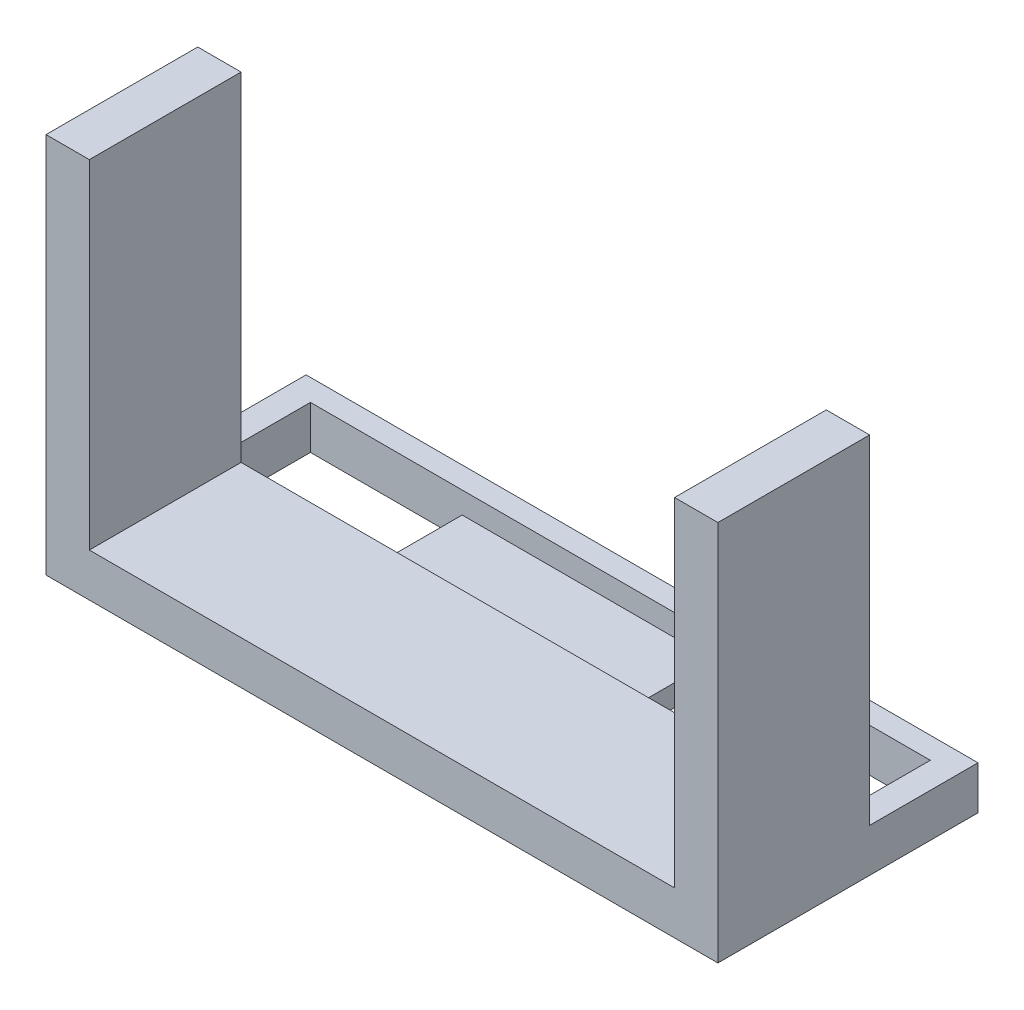
ISO-10303-21;
HEADER;
FILE_DESCRIPTION(('STEP AP214'),'2;1');
FILE_NAME('part.step','',(''),(''),'','','');
FILE_SCHEMA(('AUTOMOTIVE_DESIGN { 1 0 10303 214 1 1 1 1 }'));
ENDSEC;
DATA;
#1=APPLICATION_CONTEXT('core data for automotive mechanical design processes');
#2=APPLICATION_PROTOCOL_DEFINITION('international standard','automotive_design',2000,#1);
#3=PRODUCT_CONTEXT('',#1,'mechanical');
#4=PRODUCT('Part','Part','',(#3));
#5=PRODUCT_RELATED_PRODUCT_CATEGORY('part','',(#4));
#6=PRODUCT_DEFINITION_FORMATION('','',#4);
#7=PRODUCT_DEFINITION_CONTEXT('part definition',#1,'design');
#8=PRODUCT_DEFINITION('design','',#6,#7);
#9=PRODUCT_DEFINITION_SHAPE('','',#8);
#10=(LENGTH_UNIT() NAMED_UNIT(*) SI_UNIT(.MILLI.,.METRE.));
#11=(NAMED_UNIT(*) PLANE_ANGLE_UNIT() SI_UNIT($,.RADIAN.));
#12=(NAMED_UNIT(*) SI_UNIT($,.STERADIAN.) SOLID_ANGLE_UNIT());
#13=UNCERTAINTY_MEASURE_WITH_UNIT(LENGTH_MEASURE(1.E-05),#10,'distance_accuracy_value','');
#14=(GEOMETRIC_REPRESENTATION_CONTEXT(3) GLOBAL_UNCERTAINTY_ASSIGNED_CONTEXT((#13)) GLOBAL_UNIT_ASSIGNED_CONTEXT((#10,
#11,#12)) REPRESENTATION_CONTEXT('',''));
#15=CARTESIAN_POINT('',(0.,0.,0.));
#16=DIRECTION('',(0.,0.,1.));
#17=DIRECTION('',(1.,0.,0.));
#18=AXIS2_PLACEMENT_3D('',#15,#16,#17);
#19=CARTESIAN_POINT('',(0.,10.,0.));
#20=DIRECTION('',(0.,1.,0.));
#21=DIRECTION('',(0.,0.,1.));
#22=AXIS2_PLACEMENT_3D('',#19,#20,#21);
#23=PLANE('',#22);
#24=DIRECTION('',(1.,0.,0.));
#25=VECTOR('',#24,1.);
#26=CARTESIAN_POINT('',(0.,10.,60.));
#27=LINE('',#26,#25);
#28=CARTESIAN_POINT('',(10.,10.,60.));
#29=VERTEX_POINT('',#28);
#30=CARTESIAN_POINT('',(145.,10.,60.));
#31=VERTEX_POINT('',#30);
#32=EDGE_CURVE('E227',#29,#31,#27,.T.);
#33=ORIENTED_EDGE('',*,*,#32,.T.);
#34=DIRECTION('',(0.,0.,1.));
#35=VECTOR('',#34,1.);
#36=CARTESIAN_POINT('',(145.,10.,25.));
#37=LINE('',#36,#35);
#38=CARTESIAN_POINT('',(145.,10.,25.));
#39=VERTEX_POINT('',#38);
#40=EDGE_CURVE('E175',#39,#31,#37,.T.);
#41=ORIENTED_EDGE('',*,*,#40,.F.);
#42=DIRECTION('',(1.,0.,0.));
#43=VECTOR('',#42,1.);
#44=CARTESIAN_POINT('',(6.,10.,25.));
#45=LINE('',#44,#43);
#46=CARTESIAN_POINT('',(10.,10.,25.));
#47=VERTEX_POINT('',#46);
#48=EDGE_CURVE('E203',#47,#39,#45,.T.);
#49=ORIENTED_EDGE('',*,*,#48,.F.);
#50=DIRECTION('',(0.,0.,-1.));
#51=VECTOR('',#50,1.);
#52=CARTESIAN_POINT('',(10.,10.,25.));
#53=LINE('',#52,#51);
#54=EDGE_CURVE('E336',#29,#47,#53,.T.);
#55=ORIENTED_EDGE('',*,*,#54,.F.);
#56=EDGE_LOOP('',(#33,#41,#49,#55));
#57=FACE_BOUND('',#56,.T.);
#58=ADVANCED_FACE('F39',(#57),#23,.T.);
#59=DIRECTION('',(0.,0.,-1.));
#60=VECTOR('',#59,1.);
#61=CARTESIAN_POINT('',(149.,10.,5.));
#62=LINE('',#61,#60);
#63=CARTESIAN_POINT('',(149.,10.,25.));
#64=VERTEX_POINT('',#63);
#65=CARTESIAN_POINT('',(149.,10.,5.));
#66=VERTEX_POINT('',#65);
#67=EDGE_CURVE('E208',#64,#66,#62,.T.);
#68=ORIENTED_EDGE('',*,*,#67,.F.);
#69=DIRECTION('',(-1.,0.,0.));
#70=VECTOR('',#69,1.);
#71=CARTESIAN_POINT('',(145.,10.,25.));
#72=LINE('',#71,#70);
#73=CARTESIAN_POINT('',(155.,10.,25.));
#74=VERTEX_POINT('',#73);
#75=EDGE_CURVE('E312',#74,#64,#72,.T.);
#76=ORIENTED_EDGE('',*,*,#75,.F.);
#77=DIRECTION('',(0.,0.,-1.));
#78=VECTOR('',#77,1.);
#79=CARTESIAN_POINT('',(155.,10.,0.));
#80=LINE('',#79,#78);
#81=CARTESIAN_POINT('',(155.,10.,0.));
#82=VERTEX_POINT('',#81);
#83=EDGE_CURVE('E232',#74,#82,#80,.T.);
#84=ORIENTED_EDGE('',*,*,#83,.T.);
#85=DIRECTION('',(-1.,0.,0.));
#86=VECTOR('',#85,1.);
#87=CARTESIAN_POINT('',(0.,10.,0.));
#88=LINE('',#87,#86);
#89=CARTESIAN_POINT('',(0.,10.,0.));
#90=VERTEX_POINT('',#89);
#91=EDGE_CURVE('E235',#82,#90,#88,.T.);
#92=ORIENTED_EDGE('',*,*,#91,.T.);
#93=DIRECTION('',(0.,0.,1.));
#94=VECTOR('',#93,1.);
#95=CARTESIAN_POINT('',(0.,10.,0.));
#96=LINE('',#95,#94);
#97=CARTESIAN_POINT('',(0.,10.,25.));
#98=VERTEX_POINT('',#97);
#99=EDGE_CURVE('E224',#90,#98,#96,.T.);
#100=ORIENTED_EDGE('',*,*,#99,.T.);
#101=DIRECTION('',(-1.,0.,0.));
#102=VECTOR('',#101,1.);
#103=CARTESIAN_POINT('',(10.,10.,25.));
#104=LINE('',#103,#102);
#105=CARTESIAN_POINT('',(6.,10.,25.));
#106=VERTEX_POINT('',#105);
#107=EDGE_CURVE('E265',#106,#98,#104,.T.);
#108=ORIENTED_EDGE('',*,*,#107,.F.);
#109=DIRECTION('',(0.,0.,1.));
#110=VECTOR('',#109,1.);
#111=CARTESIAN_POINT('',(6.,10.,5.));
#112=LINE('',#111,#110);
#113=CARTESIAN_POINT('',(6.,10.,5.));
#114=VERTEX_POINT('',#113);
#115=EDGE_CURVE('E199',#114,#106,#112,.T.);
#116=ORIENTED_EDGE('',*,*,#115,.F.);
#117=DIRECTION('',(-1.,0.,0.));
#118=VECTOR('',#117,1.);
#119=CARTESIAN_POINT('',(6.,10.,5.));
#120=LINE('',#119,#118);
#121=EDGE_CURVE('E195',#66,#114,#120,.T.);
#122=ORIENTED_EDGE('',*,*,#121,.F.);
#123=EDGE_LOOP('',(#68,#76,#84,#92,#100,#108,#116,#122));
#124=FACE_BOUND('',#123,.T.);
#125=ADVANCED_FACE('F395',(#124),#23,.T.);
#126=CARTESIAN_POINT('',(0.,10.,0.));
#127=DIRECTION('',(1.,0.,0.));
#128=DIRECTION('',(0.,0.,-1.));
#129=AXIS2_PLACEMENT_3D('',#126,#127,#128);
#130=PLANE('',#129);
#131=DIRECTION('',(0.,0.,1.));
#132=VECTOR('',#131,1.);
#133=CARTESIAN_POINT('',(0.,0.,0.));
#134=LINE('',#133,#132);
#135=CARTESIAN_POINT('',(0.,0.,0.));
#136=VERTEX_POINT('',#135);
#137=CARTESIAN_POINT('',(0.,0.,60.));
#138=VERTEX_POINT('',#137);
#139=EDGE_CURVE('E217',#136,#138,#134,.T.);
#140=ORIENTED_EDGE('',*,*,#139,.T.);
#141=DIRECTION('',(0.,-1.,0.));
#142=VECTOR('',#141,1.);
#143=CARTESIAN_POINT('',(0.,10.,60.));
#144=LINE('',#143,#142);
#145=CARTESIAN_POINT('',(0.,88.,60.));
#146=VERTEX_POINT('',#145);
#147=EDGE_CURVE('E261',#146,#138,#144,.T.);
#148=ORIENTED_EDGE('',*,*,#147,.F.);
#149=DIRECTION('',(0.,0.,1.));
#150=VECTOR('',#149,1.);
#151=CARTESIAN_POINT('',(0.,88.,25.));
#152=LINE('',#151,#150);
#153=CARTESIAN_POINT('',(0.,88.,25.));
#154=VERTEX_POINT('',#153);
#155=EDGE_CURVE('E344',#154,#146,#152,.T.);
#156=ORIENTED_EDGE('',*,*,#155,.F.);
#157=DIRECTION('',(0.,-1.,0.));
#158=VECTOR('',#157,1.);
#159=CARTESIAN_POINT('',(0.,88.,25.));
#160=LINE('',#159,#158);
#161=EDGE_CURVE('E360',#154,#98,#160,.T.);
#162=ORIENTED_EDGE('',*,*,#161,.T.);
#163=ORIENTED_EDGE('',*,*,#99,.F.);
#164=DIRECTION('',(0.,-1.,0.));
#165=VECTOR('',#164,1.);
#166=CARTESIAN_POINT('',(0.,10.,0.));
#167=LINE('',#166,#165);
#168=EDGE_CURVE('E238',#90,#136,#167,.T.);
#169=ORIENTED_EDGE('',*,*,#168,.T.);
#170=EDGE_LOOP('',(#140,#148,#156,#162,#163,#169));
#171=FACE_BOUND('',#170,.T.);
#172=ADVANCED_FACE('F41',(#171),#130,.F.);
#173=CARTESIAN_POINT('',(0.,10.,60.));
#174=DIRECTION('',(0.,0.,-1.));
#175=DIRECTION('',(-1.,0.,0.));
#176=AXIS2_PLACEMENT_3D('',#173,#174,#175);
#177=PLANE('',#176);
#178=DIRECTION('',(1.,0.,0.));
#179=VECTOR('',#178,1.);
#180=CARTESIAN_POINT('',(0.,0.,60.));
#181=LINE('',#180,#179);
#182=CARTESIAN_POINT('',(155.,0.,60.));
#183=VERTEX_POINT('',#182);
#184=EDGE_CURVE('E242',#138,#183,#181,.T.);
#185=ORIENTED_EDGE('',*,*,#184,.T.);
#186=DIRECTION('',(0.,-1.,0.));
#187=VECTOR('',#186,1.);
#188=CARTESIAN_POINT('',(155.,10.,60.));
#189=LINE('',#188,#187);
#190=CARTESIAN_POINT('',(155.,88.,60.));
#191=VERTEX_POINT('',#190);
#192=EDGE_CURVE('E257',#191,#183,#189,.T.);
#193=ORIENTED_EDGE('',*,*,#192,.F.);
#194=DIRECTION('',(1.,0.,0.));
#195=VECTOR('',#194,1.);
#196=CARTESIAN_POINT('',(145.,88.,60.));
#197=LINE('',#196,#195);
#198=CARTESIAN_POINT('',(145.,88.,60.));
#199=VERTEX_POINT('',#198);
#200=EDGE_CURVE('E311',#199,#191,#197,.T.);
#201=ORIENTED_EDGE('',*,*,#200,.F.);
#202=DIRECTION('',(0.,-1.,0.));
#203=VECTOR('',#202,1.);
#204=CARTESIAN_POINT('',(145.,88.,60.));
#205=LINE('',#204,#203);
#206=EDGE_CURVE('E333',#199,#31,#205,.T.);
#207=ORIENTED_EDGE('',*,*,#206,.T.);
#208=ORIENTED_EDGE('',*,*,#32,.F.);
#209=DIRECTION('',(0.,-1.,0.));
#210=VECTOR('',#209,1.);
#211=CARTESIAN_POINT('',(10.,88.,60.));
#212=LINE('',#211,#210);
#213=CARTESIAN_POINT('',(10.,88.,60.));
#214=VERTEX_POINT('',#213);
#215=EDGE_CURVE('E351',#214,#29,#212,.T.);
#216=ORIENTED_EDGE('',*,*,#215,.F.);
#217=DIRECTION('',(1.,0.,0.));
#218=VECTOR('',#217,1.);
#219=CARTESIAN_POINT('',(10.,88.,60.));
#220=LINE('',#219,#218);
#221=EDGE_CURVE('E348',#146,#214,#220,.T.);
#222=ORIENTED_EDGE('',*,*,#221,.F.);
#223=ORIENTED_EDGE('',*,*,#147,.T.);
#224=EDGE_LOOP('',(#185,#193,#201,#207,#208,#216,#222,#223));
#225=FACE_BOUND('',#224,.T.);
#226=ADVANCED_FACE('F376',(#225),#177,.F.);
#227=CARTESIAN_POINT('',(155.,10.,0.));
#228=DIRECTION('',(-1.,0.,0.));
#229=DIRECTION('',(0.,0.,1.));
#230=AXIS2_PLACEMENT_3D('',#227,#228,#229);
#231=PLANE('',#230);
#232=DIRECTION('',(0.,0.,-1.));
#233=VECTOR('',#232,1.);
#234=CARTESIAN_POINT('',(155.,0.,0.));
#235=LINE('',#234,#233);
#236=CARTESIAN_POINT('',(155.,0.,0.));
#237=VERTEX_POINT('',#236);
#238=EDGE_CURVE('E245',#183,#237,#235,.T.);
#239=ORIENTED_EDGE('',*,*,#238,.T.);
#240=DIRECTION('',(0.,-1.,0.));
#241=VECTOR('',#240,1.);
#242=CARTESIAN_POINT('',(155.,10.,0.));
#243=LINE('',#242,#241);
#244=EDGE_CURVE('E253',#82,#237,#243,.T.);
#245=ORIENTED_EDGE('',*,*,#244,.F.);
#246=ORIENTED_EDGE('',*,*,#83,.F.);
#247=DIRECTION('',(0.,-1.,0.));
#248=VECTOR('',#247,1.);
#249=CARTESIAN_POINT('',(155.,88.,25.));
#250=LINE('',#249,#248);
#251=CARTESIAN_POINT('',(155.,88.,25.));
#252=VERTEX_POINT('',#251);
#253=EDGE_CURVE('E330',#252,#74,#250,.T.);
#254=ORIENTED_EDGE('',*,*,#253,.F.);
#255=DIRECTION('',(0.,0.,-1.));
#256=VECTOR('',#255,1.);
#257=CARTESIAN_POINT('',(155.,88.,25.));
#258=LINE('',#257,#256);
#259=EDGE_CURVE('E316',#191,#252,#258,.T.);
#260=ORIENTED_EDGE('',*,*,#259,.F.);
#261=ORIENTED_EDGE('',*,*,#192,.T.);
#262=EDGE_LOOP('',(#239,#245,#246,#254,#260,#261));
#263=FACE_BOUND('',#262,.T.);
#264=ADVANCED_FACE('F390',(#263),#231,.F.);
#265=CARTESIAN_POINT('',(0.,10.,0.));
#266=DIRECTION('',(0.,0.,1.));
#267=DIRECTION('',(1.,0.,0.));
#268=AXIS2_PLACEMENT_3D('',#265,#266,#267);
#269=PLANE('',#268);
#270=DIRECTION('',(-1.,0.,0.));
#271=VECTOR('',#270,1.);
#272=CARTESIAN_POINT('',(0.,0.,0.));
#273=LINE('',#272,#271);
#274=EDGE_CURVE('E228',#237,#136,#273,.T.);
#275=ORIENTED_EDGE('',*,*,#274,.T.);
#276=ORIENTED_EDGE('',*,*,#168,.F.);
#277=ORIENTED_EDGE('',*,*,#91,.F.);
#278=ORIENTED_EDGE('',*,*,#244,.T.);
#279=EDGE_LOOP('',(#275,#276,#277,#278));
#280=FACE_BOUND('',#279,.T.);
#281=ADVANCED_FACE('F415',(#280),#269,.F.);
#282=CARTESIAN_POINT('',(0.,0.,0.));
#283=DIRECTION('',(0.,1.,0.));
#284=DIRECTION('',(0.,0.,1.));
#285=AXIS2_PLACEMENT_3D('',#282,#283,#284);
#286=PLANE('',#285);
#287=DIRECTION('',(-1.,0.,0.));
#288=VECTOR('',#287,1.);
#289=CARTESIAN_POINT('',(0.,0.,5.));
#290=LINE('',#289,#288);
#291=CARTESIAN_POINT('',(41.,0.,5.));
#292=VERTEX_POINT('',#291);
#293=CARTESIAN_POINT('',(6.,0.,5.));
#294=VERTEX_POINT('',#293);
#295=EDGE_CURVE('E48',#292,#294,#290,.T.);
#296=ORIENTED_EDGE('',*,*,#295,.T.);
#297=DIRECTION('',(0.,0.,1.));
#298=VECTOR('',#297,1.);
#299=CARTESIAN_POINT('',(6.,0.,0.));
#300=LINE('',#299,#298);
#301=CARTESIAN_POINT('',(6.,0.,25.));
#302=VERTEX_POINT('',#301);
#303=EDGE_CURVE('E11',#294,#302,#300,.T.);
#304=ORIENTED_EDGE('',*,*,#303,.T.);
#305=DIRECTION('',(1.,0.,0.));
#306=VECTOR('',#305,1.);
#307=CARTESIAN_POINT('',(0.,0.,25.));
#308=LINE('',#307,#306);
#309=CARTESIAN_POINT('',(41.,0.,25.));
#310=VERTEX_POINT('',#309);
#311=EDGE_CURVE('E282',#302,#310,#308,.T.);
#312=ORIENTED_EDGE('',*,*,#311,.T.);
#313=DIRECTION('',(0.,0.,-1.));
#314=VECTOR('',#313,1.);
#315=CARTESIAN_POINT('',(41.,0.,0.));
#316=LINE('',#315,#314);
#317=EDGE_CURVE('E286',#310,#292,#316,.T.);
#318=ORIENTED_EDGE('',*,*,#317,.T.);
#319=EDGE_LOOP('',(#296,#304,#312,#318));
#320=FACE_BOUND('',#319,.T.);
#321=DIRECTION('',(-1.,0.,0.));
#322=VECTOR('',#321,1.);
#323=CARTESIAN_POINT('',(0.,0.,5.));
#324=LINE('',#323,#322);
#325=CARTESIAN_POINT('',(149.,0.,5.));
#326=VERTEX_POINT('',#325);
#327=CARTESIAN_POINT('',(99.,0.,5.));
#328=VERTEX_POINT('',#327);
#329=EDGE_CURVE('E274',#326,#328,#324,.T.);
#330=ORIENTED_EDGE('',*,*,#329,.T.);
#331=DIRECTION('',(0.,0.,1.));
#332=VECTOR('',#331,1.);
#333=CARTESIAN_POINT('',(99.,0.,0.));
#334=LINE('',#333,#332);
#335=CARTESIAN_POINT('',(99.,0.,25.));
#336=VERTEX_POINT('',#335);
#337=EDGE_CURVE('E278',#328,#336,#334,.T.);
#338=ORIENTED_EDGE('',*,*,#337,.T.);
#339=DIRECTION('',(1.,0.,0.));
#340=VECTOR('',#339,1.);
#341=CARTESIAN_POINT('',(0.,0.,25.));
#342=LINE('',#341,#340);
#343=CARTESIAN_POINT('',(149.,0.,25.));
#344=VERTEX_POINT('',#343);
#345=EDGE_CURVE('E266',#336,#344,#342,.T.);
#346=ORIENTED_EDGE('',*,*,#345,.T.);
#347=DIRECTION('',(0.,0.,-1.));
#348=VECTOR('',#347,1.);
#349=CARTESIAN_POINT('',(149.,0.,0.));
#350=LINE('',#349,#348);
#351=EDGE_CURVE('E270',#344,#326,#350,.T.);
#352=ORIENTED_EDGE('',*,*,#351,.T.);
#353=EDGE_LOOP('',(#330,#338,#346,#352));
#354=FACE_BOUND('',#353,.T.);
#355=ORIENTED_EDGE('',*,*,#139,.F.);
#356=ORIENTED_EDGE('',*,*,#274,.F.);
#357=ORIENTED_EDGE('',*,*,#238,.F.);
#358=ORIENTED_EDGE('',*,*,#184,.F.);
#359=EDGE_LOOP('',(#355,#356,#357,#358));
#360=FACE_BOUND('',#359,.T.);
#361=ADVANCED_FACE('F290',(#320,#354,#360),#286,.F.);
#362=CARTESIAN_POINT('',(6.,5.,5.));
#363=DIRECTION('',(-1.,0.,0.));
#364=DIRECTION('',(0.,0.,1.));
#365=AXIS2_PLACEMENT_3D('',#362,#363,#364);
#366=PLANE('',#365);
#367=ORIENTED_EDGE('',*,*,#115,.T.);
#368=DIRECTION('',(0.,1.,0.));
#369=VECTOR('',#368,1.);
#370=CARTESIAN_POINT('',(6.,5.,25.));
#371=LINE('',#370,#369);
#372=EDGE_CURVE('E187',#302,#106,#371,.T.);
#373=ORIENTED_EDGE('',*,*,#372,.F.);
#374=ORIENTED_EDGE('',*,*,#303,.F.);
#375=DIRECTION('',(0.,1.,0.));
#376=VECTOR('',#375,1.);
#377=CARTESIAN_POINT('',(6.,5.,5.));
#378=LINE('',#377,#376);
#379=EDGE_CURVE('E214',#294,#114,#378,.T.);
#380=ORIENTED_EDGE('',*,*,#379,.T.);
#381=EDGE_LOOP('',(#367,#373,#374,#380));
#382=FACE_BOUND('',#381,.T.);
#383=ADVANCED_FACE('F407',(#382),#366,.F.);
#384=CARTESIAN_POINT('',(6.,5.,5.));
#385=DIRECTION('',(0.,0.,-1.));
#386=DIRECTION('',(-1.,0.,0.));
#387=AXIS2_PLACEMENT_3D('',#384,#385,#386);
#388=PLANE('',#387);
#389=ORIENTED_EDGE('',*,*,#121,.T.);
#390=ORIENTED_EDGE('',*,*,#379,.F.);
#391=ORIENTED_EDGE('',*,*,#295,.F.);
#392=DIRECTION('',(0.,1.,0.));
#393=VECTOR('',#392,1.);
#394=CARTESIAN_POINT('',(41.,-73.,5.));
#395=LINE('',#394,#393);
#396=CARTESIAN_POINT('',(41.,5.,5.));
#397=VERTEX_POINT('',#396);
#398=EDGE_CURVE('E167',#292,#397,#395,.T.);
#399=ORIENTED_EDGE('',*,*,#398,.T.);
#400=DIRECTION('',(-1.,0.,0.));
#401=VECTOR('',#400,1.);
#402=CARTESIAN_POINT('',(6.,5.,5.));
#403=LINE('',#402,#401);
#404=CARTESIAN_POINT('',(99.,5.,5.));
#405=VERTEX_POINT('',#404);
#406=EDGE_CURVE('E171',#405,#397,#403,.T.);
#407=ORIENTED_EDGE('',*,*,#406,.F.);
#408=DIRECTION('',(0.,1.,0.));
#409=VECTOR('',#408,1.);
#410=CARTESIAN_POINT('',(99.,-73.,5.));
#411=LINE('',#410,#409);
#412=EDGE_CURVE('E55',#328,#405,#411,.T.);
#413=ORIENTED_EDGE('',*,*,#412,.F.);
#414=ORIENTED_EDGE('',*,*,#329,.F.);
#415=DIRECTION('',(0.,1.,0.));
#416=VECTOR('',#415,1.);
#417=CARTESIAN_POINT('',(149.,5.,5.));
#418=LINE('',#417,#416);
#419=EDGE_CURVE('E218',#326,#66,#418,.T.);
#420=ORIENTED_EDGE('',*,*,#419,.T.);
#421=EDGE_LOOP('',(#389,#390,#391,#399,#407,#413,#414,#420));
#422=FACE_BOUND('',#421,.T.);
#423=ADVANCED_FACE('F169',(#422),#388,.F.);
#424=CARTESIAN_POINT('',(149.,5.,5.));
#425=DIRECTION('',(1.,0.,0.));
#426=DIRECTION('',(0.,0.,-1.));
#427=AXIS2_PLACEMENT_3D('',#424,#425,#426);
#428=PLANE('',#427);
#429=ORIENTED_EDGE('',*,*,#67,.T.);
#430=ORIENTED_EDGE('',*,*,#419,.F.);
#431=ORIENTED_EDGE('',*,*,#351,.F.);
#432=DIRECTION('',(0.,1.,0.));
#433=VECTOR('',#432,1.);
#434=CARTESIAN_POINT('',(149.,5.,25.));
#435=LINE('',#434,#433);
#436=EDGE_CURVE('E193',#344,#64,#435,.T.);
#437=ORIENTED_EDGE('',*,*,#436,.T.);
#438=EDGE_LOOP('',(#429,#430,#431,#437));
#439=FACE_BOUND('',#438,.T.);
#440=ADVANCED_FACE('F400',(#439),#428,.F.);
#441=CARTESIAN_POINT('',(6.,5.,25.));
#442=DIRECTION('',(0.,0.,1.));
#443=DIRECTION('',(1.,0.,0.));
#444=AXIS2_PLACEMENT_3D('',#441,#442,#443);
#445=PLANE('',#444);
#446=ORIENTED_EDGE('',*,*,#372,.T.);
#447=ORIENTED_EDGE('',*,*,#107,.T.);
#448=ORIENTED_EDGE('',*,*,#161,.F.);
#449=DIRECTION('',(-1.,0.,0.));
#450=VECTOR('',#449,1.);
#451=CARTESIAN_POINT('',(10.,88.,25.));
#452=LINE('',#451,#450);
#453=CARTESIAN_POINT('',(10.,88.,25.));
#454=VERTEX_POINT('',#453);
#455=EDGE_CURVE('E341',#454,#154,#452,.T.);
#456=ORIENTED_EDGE('',*,*,#455,.F.);
#457=DIRECTION('',(0.,-1.,0.));
#458=VECTOR('',#457,1.);
#459=CARTESIAN_POINT('',(10.,88.,25.));
#460=LINE('',#459,#458);
#461=EDGE_CURVE('E204',#454,#47,#460,.T.);
#462=ORIENTED_EDGE('',*,*,#461,.T.);
#463=ORIENTED_EDGE('',*,*,#48,.T.);
#464=DIRECTION('',(0.,-1.,0.));
#465=VECTOR('',#464,1.);
#466=CARTESIAN_POINT('',(145.,88.,25.));
#467=LINE('',#466,#465);
#468=CARTESIAN_POINT('',(145.,88.,25.));
#469=VERTEX_POINT('',#468);
#470=EDGE_CURVE('E322',#469,#39,#467,.T.);
#471=ORIENTED_EDGE('',*,*,#470,.F.);
#472=DIRECTION('',(-1.,0.,0.));
#473=VECTOR('',#472,1.);
#474=CARTESIAN_POINT('',(145.,88.,25.));
#475=LINE('',#474,#473);
#476=EDGE_CURVE('E319',#252,#469,#475,.T.);
#477=ORIENTED_EDGE('',*,*,#476,.F.);
#478=ORIENTED_EDGE('',*,*,#253,.T.);
#479=ORIENTED_EDGE('',*,*,#75,.T.);
#480=ORIENTED_EDGE('',*,*,#436,.F.);
#481=ORIENTED_EDGE('',*,*,#345,.F.);
#482=DIRECTION('',(0.,1.,0.));
#483=VECTOR('',#482,1.);
#484=CARTESIAN_POINT('',(99.,-73.,25.));
#485=LINE('',#484,#483);
#486=CARTESIAN_POINT('',(99.,5.,25.));
#487=VERTEX_POINT('',#486);
#488=EDGE_CURVE('E302',#336,#487,#485,.T.);
#489=ORIENTED_EDGE('',*,*,#488,.T.);
#490=DIRECTION('',(1.,0.,0.));
#491=VECTOR('',#490,1.);
#492=CARTESIAN_POINT('',(6.,5.,25.));
#493=LINE('',#492,#491);
#494=CARTESIAN_POINT('',(41.,5.,25.));
#495=VERTEX_POINT('',#494);
#496=EDGE_CURVE('E188',#495,#487,#493,.T.);
#497=ORIENTED_EDGE('',*,*,#496,.F.);
#498=DIRECTION('',(0.,1.,0.));
#499=VECTOR('',#498,1.);
#500=CARTESIAN_POINT('',(41.,-73.,25.));
#501=LINE('',#500,#499);
#502=EDGE_CURVE('E63',#310,#495,#501,.T.);
#503=ORIENTED_EDGE('',*,*,#502,.F.);
#504=ORIENTED_EDGE('',*,*,#311,.F.);
#505=EDGE_LOOP('',(#446,#447,#448,#456,#462,#463,#471,#477,#478,#479,#480,#481,#489,#497,#503,#504));
#506=FACE_BOUND('',#505,.T.);
#507=ADVANCED_FACE('F295',(#506),#445,.F.);
#508=CARTESIAN_POINT('',(0.,5.,0.));
#509=DIRECTION('',(0.,1.,0.));
#510=DIRECTION('',(0.,0.,1.));
#511=AXIS2_PLACEMENT_3D('',#508,#509,#510);
#512=PLANE('',#511);
#513=DIRECTION('',(0.,0.,-1.));
#514=VECTOR('',#513,1.);
#515=CARTESIAN_POINT('',(41.,5.,5.));
#516=LINE('',#515,#514);
#517=EDGE_CURVE('E177',#495,#397,#516,.T.);
#518=ORIENTED_EDGE('',*,*,#517,.F.);
#519=ORIENTED_EDGE('',*,*,#496,.T.);
#520=DIRECTION('',(0.,0.,1.));
#521=VECTOR('',#520,1.);
#522=CARTESIAN_POINT('',(99.,5.,5.));
#523=LINE('',#522,#521);
#524=EDGE_CURVE('E185',#405,#487,#523,.T.);
#525=ORIENTED_EDGE('',*,*,#524,.F.);
#526=ORIENTED_EDGE('',*,*,#406,.T.);
#527=EDGE_LOOP('',(#518,#519,#525,#526));
#528=FACE_BOUND('',#527,.T.);
#529=ADVANCED_FACE('F184',(#528),#512,.T.);
#530=CARTESIAN_POINT('',(10.,88.,25.));
#531=DIRECTION('',(-1.,0.,0.));
#532=DIRECTION('',(0.,0.,1.));
#533=AXIS2_PLACEMENT_3D('',#530,#531,#532);
#534=PLANE('',#533);
#535=ORIENTED_EDGE('',*,*,#54,.T.);
#536=ORIENTED_EDGE('',*,*,#461,.F.);
#537=DIRECTION('',(0.,0.,-1.));
#538=VECTOR('',#537,1.);
#539=CARTESIAN_POINT('',(10.,88.,25.));
#540=LINE('',#539,#538);
#541=EDGE_CURVE('E337',#214,#454,#540,.T.);
#542=ORIENTED_EDGE('',*,*,#541,.F.);
#543=ORIENTED_EDGE('',*,*,#215,.T.);
#544=EDGE_LOOP('',(#535,#536,#542,#543));
#545=FACE_BOUND('',#544,.T.);
#546=ADVANCED_FACE('F370',(#545),#534,.F.);
#547=CARTESIAN_POINT('',(0.,88.,0.));
#548=DIRECTION('',(0.,-1.,0.));
#549=DIRECTION('',(0.,0.,-1.));
#550=AXIS2_PLACEMENT_3D('',#547,#548,#549);
#551=PLANE('',#550);
#552=ORIENTED_EDGE('',*,*,#541,.T.);
#553=ORIENTED_EDGE('',*,*,#455,.T.);
#554=ORIENTED_EDGE('',*,*,#155,.T.);
#555=ORIENTED_EDGE('',*,*,#221,.T.);
#556=EDGE_LOOP('',(#552,#553,#554,#555));
#557=FACE_BOUND('',#556,.T.);
#558=ADVANCED_FACE('F441',(#557),#551,.F.);
#559=CARTESIAN_POINT('',(145.,88.,25.));
#560=DIRECTION('',(1.,0.,0.));
#561=DIRECTION('',(0.,0.,-1.));
#562=AXIS2_PLACEMENT_3D('',#559,#560,#561);
#563=PLANE('',#562);
#564=ORIENTED_EDGE('',*,*,#40,.T.);
#565=ORIENTED_EDGE('',*,*,#206,.F.);
#566=DIRECTION('',(0.,0.,1.));
#567=VECTOR('',#566,1.);
#568=CARTESIAN_POINT('',(145.,88.,25.));
#569=LINE('',#568,#567);
#570=EDGE_CURVE('E307',#469,#199,#569,.T.);
#571=ORIENTED_EDGE('',*,*,#570,.F.);
#572=ORIENTED_EDGE('',*,*,#470,.T.);
#573=EDGE_LOOP('',(#564,#565,#571,#572));
#574=FACE_BOUND('',#573,.T.);
#575=ADVANCED_FACE('F381',(#574),#563,.F.);
#576=CARTESIAN_POINT('',(0.,88.,0.));
#577=DIRECTION('',(0.,1.,0.));
#578=DIRECTION('',(0.,0.,1.));
#579=AXIS2_PLACEMENT_3D('',#576,#577,#578);
#580=PLANE('',#579);
#581=ORIENTED_EDGE('',*,*,#570,.T.);
#582=ORIENTED_EDGE('',*,*,#200,.T.);
#583=ORIENTED_EDGE('',*,*,#259,.T.);
#584=ORIENTED_EDGE('',*,*,#476,.T.);
#585=EDGE_LOOP('',(#581,#582,#583,#584));
#586=FACE_BOUND('',#585,.T.);
#587=ADVANCED_FACE('F386',(#586),#580,.T.);
#588=CARTESIAN_POINT('',(99.,-73.,5.));
#589=DIRECTION('',(-1.,0.,0.));
#590=DIRECTION('',(0.,0.,1.));
#591=AXIS2_PLACEMENT_3D('',#588,#589,#590);
#592=PLANE('',#591);
#593=ORIENTED_EDGE('',*,*,#412,.T.);
#594=ORIENTED_EDGE('',*,*,#524,.T.);
#595=ORIENTED_EDGE('',*,*,#488,.F.);
#596=ORIENTED_EDGE('',*,*,#337,.F.);
#597=EDGE_LOOP('',(#593,#594,#595,#596));
#598=FACE_BOUND('',#597,.T.);
#599=ADVANCED_FACE('F404',(#598),#592,.F.);
#600=CARTESIAN_POINT('',(41.,-73.,5.));
#601=DIRECTION('',(1.,0.,0.));
#602=DIRECTION('',(0.,0.,-1.));
#603=AXIS2_PLACEMENT_3D('',#600,#601,#602);
#604=PLANE('',#603);
#605=ORIENTED_EDGE('',*,*,#502,.T.);
#606=ORIENTED_EDGE('',*,*,#517,.T.);
#607=ORIENTED_EDGE('',*,*,#398,.F.);
#608=ORIENTED_EDGE('',*,*,#317,.F.);
#609=EDGE_LOOP('',(#605,#606,#607,#608));
#610=FACE_BOUND('',#609,.T.);
#611=ADVANCED_FACE('F178',(#610),#604,.F.);
#612=CLOSED_SHELL('',(#58,#125,#172,#226,#264,#281,#361,#383,#423,#440,#507,#529,#546,#558,#575,
#587,#599,#611));
#613=MANIFOLD_SOLID_BREP('B2',#612);
#614=ADVANCED_BREP_SHAPE_REPRESENTATION('',(#18,#613),#14);
#615=SHAPE_DEFINITION_REPRESENTATION(#9,#614);
ENDSEC;
END-ISO-10303-21;
